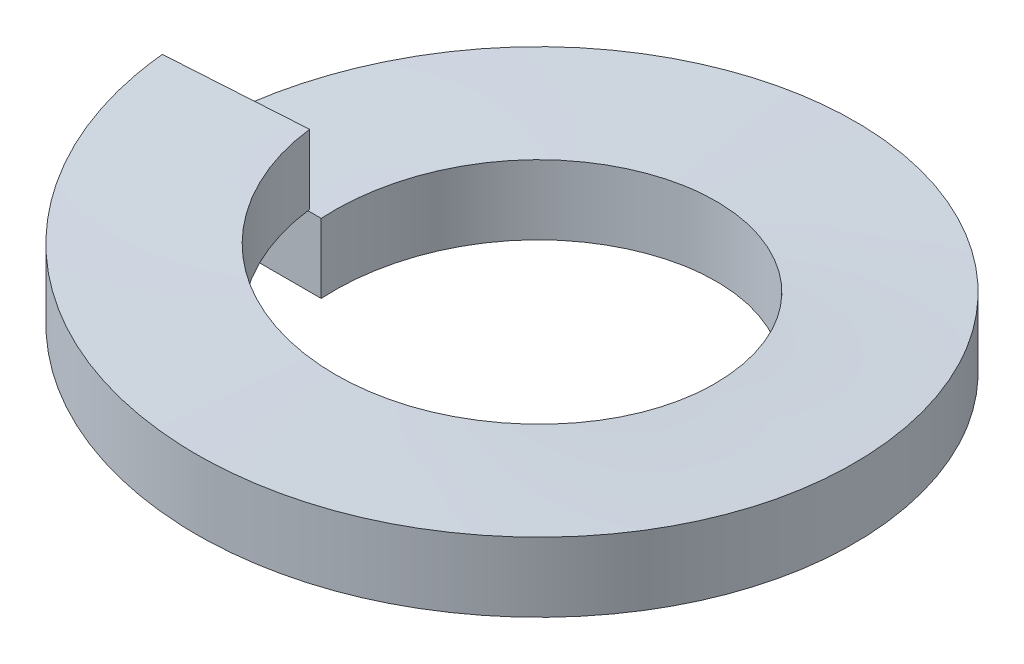
ISO-10303-21;
HEADER;
FILE_DESCRIPTION(('STEP AP214'),'2;1');
FILE_NAME('part.step','',(''),(''),'','','');
FILE_SCHEMA(('AUTOMOTIVE_DESIGN { 1 0 10303 214 1 1 1 1 }'));
ENDSEC;
DATA;
#1=APPLICATION_CONTEXT('core data for automotive mechanical design processes');
#2=APPLICATION_PROTOCOL_DEFINITION('international standard','automotive_design',2000,#1);
#3=PRODUCT_CONTEXT('',#1,'mechanical');
#4=PRODUCT('Part','Part','',(#3));
#5=PRODUCT_RELATED_PRODUCT_CATEGORY('part','',(#4));
#6=PRODUCT_DEFINITION_FORMATION('','',#4);
#7=PRODUCT_DEFINITION_CONTEXT('part definition',#1,'design');
#8=PRODUCT_DEFINITION('design','',#6,#7);
#9=PRODUCT_DEFINITION_SHAPE('','',#8);
#10=(LENGTH_UNIT() NAMED_UNIT(*) SI_UNIT(.MILLI.,.METRE.));
#11=(NAMED_UNIT(*) PLANE_ANGLE_UNIT() SI_UNIT($,.RADIAN.));
#12=(NAMED_UNIT(*) SI_UNIT($,.STERADIAN.) SOLID_ANGLE_UNIT());
#13=UNCERTAINTY_MEASURE_WITH_UNIT(LENGTH_MEASURE(1.E-05),#10,'distance_accuracy_value','');
#14=(GEOMETRIC_REPRESENTATION_CONTEXT(3) GLOBAL_UNCERTAINTY_ASSIGNED_CONTEXT((#13)) GLOBAL_UNIT_ASSIGNED_CONTEXT((#10,
#11,#12)) REPRESENTATION_CONTEXT('',''));
#15=CARTESIAN_POINT('',(0.,0.,0.));
#16=DIRECTION('',(0.,0.,1.));
#17=DIRECTION('',(1.,0.,0.));
#18=AXIS2_PLACEMENT_3D('',#15,#16,#17);
#19=CARTESIAN_POINT('',(0.,0.,0.));
#20=DIRECTION('',(0.,1.,0.));
#21=DIRECTION('',(1.,0.,0.));
#22=AXIS2_PLACEMENT_3D('',#19,#20,#21);
#23=CYLINDRICAL_SURFACE('',#22,2.2);
#24=CARTESIAN_POINT('',(-2.2,0.,0.));
#25=CARTESIAN_POINT('',(-2.2,0.08,-1.25485784528125));
#26=CARTESIAN_POINT('',(-1.11989111465081,0.16,-1.89363245940868));
#27=CARTESIAN_POINT('',(-0.601851894780919,0.1983694071512,-2.2));
#28=CARTESIAN_POINT('',(0.,0.242536206277147,-2.2));
#29=(BOUNDED_CURVE() B_SPLINE_CURVE(2,(#24,#25,#26,#27,#28),.UNSPECIFIED.,.F.,
.F.) B_SPLINE_CURVE_WITH_KNOTS((3,2,3),(0.,0.166666666666667,0.252468503816904),
.UNSPECIFIED.) CURVE() GEOMETRIC_REPRESENTATION_ITEM() RATIONAL_B_SPLINE_CURVE((1.,
0.868631514438191,1.,0.932370055570913,0.934373392882436)) REPRESENTATION_ITEM(''));
#30=CARTESIAN_POINT('',(-2.2,0.,0.));
#31=VERTEX_POINT('',#30);
#32=CARTESIAN_POINT('',(0.,0.242536206277147,-2.2));
#33=VERTEX_POINT('',#32);
#34=EDGE_CURVE('E10',#31,#33,#29,.T.);
#35=ORIENTED_EDGE('',*,*,#34,.T.);
#36=CARTESIAN_POINT('',(0.,0.242536206277147,-2.2));
#37=CARTESIAN_POINT('',(0.564863992809004,0.283988654496086,-2.2));
#38=CARTESIAN_POINT('',(1.05985808302378,0.32,-1.9278746960965));
#39=CARTESIAN_POINT('',(2.15949839534919,0.4,-1.32334231865688));
#40=CARTESIAN_POINT('',(2.19891443280461,0.48,-0.0691036699718665));
#41=CARTESIAN_POINT('',(2.23833047026003,0.56,1.18513497871315));
#42=CARTESIAN_POINT('',(1.17881894895378,0.64,1.85752143610444));
#43=CARTESIAN_POINT('',(0.639159084810205,0.680747824127725,2.2));
#44=CARTESIAN_POINT('',(0.,0.727606115902046,2.2));
#45=(BOUNDED_CURVE() B_SPLINE_CURVE(2,(#36,#37,#38,#39,#40,#41,#42,#43,#44),.UNSPECIFIED.,.F.,
.F.) B_SPLINE_CURVE_WITH_KNOTS((3,2,2,2,3),(0.252468503816904,0.333333333333333,0.5,
0.666666666666667,0.757406729884102),
.UNSPECIFIED.) CURVE() GEOMETRIC_REPRESENTATION_ITEM() RATIONAL_B_SPLINE_CURVE((0.934373392882436,
0.936261458867277,1.,0.868631514438191,1.,0.868631514438191,1.,0.928477691892056,0.934834648894173)) REPRESENTATION_ITEM(''));
#46=CARTESIAN_POINT('',(0.,0.727606115902047,2.2));
#47=VERTEX_POINT('',#46);
#48=EDGE_CURVE('E24',#33,#47,#45,.T.);
#49=ORIENTED_EDGE('',*,*,#48,.T.);
#50=CARTESIAN_POINT('',(0.,0.727606115902046,2.2));
#51=CARTESIAN_POINT('',(-0.528173269976269,0.766327770307217,2.2));
#52=CARTESIAN_POINT('',(-0.998779099427025,0.8,1.9602143532144));
#53=CARTESIAN_POINT('',(-2.11686562650157,0.88,1.39052081293306));
#54=CARTESIAN_POINT('',(-2.1956588025422,0.96,0.138139142964459));
#55=(BOUNDED_CURVE() B_SPLINE_CURVE(2,(#50,#51,#52,#53,#54),.UNSPECIFIED.,.F.,
.F.) B_SPLINE_CURVE_WITH_KNOTS((3,2,3),(0.757406729884102,0.833333333333333,1.),
.UNSPECIFIED.) CURVE() GEOMETRIC_REPRESENTATION_ITEM() RATIONAL_B_SPLINE_CURVE((0.934834648894173,
0.940153822546135,1.,0.868631514438191,1.)) REPRESENTATION_ITEM(''));
#56=CARTESIAN_POINT('',(-2.1956588025422,0.96,0.138139142964459));
#57=VERTEX_POINT('',#56);
#58=EDGE_CURVE('E174',#47,#57,#55,.T.);
#59=ORIENTED_EDGE('',*,*,#58,.T.);
#60=DIRECTION('',(0.,1.,0.));
#61=VECTOR('',#60,1.);
#62=CARTESIAN_POINT('',(-2.1956588025422,0.96,0.13813914296446));
#63=LINE('',#62,#61);
#64=CARTESIAN_POINT('',(-2.1956588025422,1.76,0.138139142964459));
#65=VERTEX_POINT('',#64);
#66=EDGE_CURVE('E96',#57,#65,#63,.T.);
#67=ORIENTED_EDGE('',*,*,#66,.T.);
#68=CARTESIAN_POINT('',(0.,1.52760611590205,2.2));
#69=CARTESIAN_POINT('',(-0.528173269976269,1.56632777030722,2.2));
#70=CARTESIAN_POINT('',(-0.998779099427025,1.6,1.9602143532144));
#71=CARTESIAN_POINT('',(-2.11686562650157,1.68,1.39052081293306));
#72=CARTESIAN_POINT('',(-2.1956588025422,1.76,0.138139142964459));
#73=(BOUNDED_CURVE() B_SPLINE_CURVE(2,(#68,#69,#70,#71,#72),.UNSPECIFIED.,.F.,
.F.) B_SPLINE_CURVE_WITH_KNOTS((3,2,3),(0.757406729884102,0.833333333333333,1.),
.UNSPECIFIED.) CURVE() GEOMETRIC_REPRESENTATION_ITEM() RATIONAL_B_SPLINE_CURVE((0.934834648894173,
0.940153822546135,1.,0.868631514438191,1.)) REPRESENTATION_ITEM(''));
#74=CARTESIAN_POINT('',(0.,1.52760611590205,2.2));
#75=VERTEX_POINT('',#74);
#76=EDGE_CURVE('E163',#75,#65,#73,.T.);
#77=ORIENTED_EDGE('',*,*,#76,.F.);
#78=CARTESIAN_POINT('',(0.,1.04253620627715,-2.2));
#79=CARTESIAN_POINT('',(0.564863992809004,1.08398865449609,-2.2));
#80=CARTESIAN_POINT('',(1.05985808302378,1.12,-1.9278746960965));
#81=CARTESIAN_POINT('',(2.15949839534919,1.2,-1.32334231865688));
#82=CARTESIAN_POINT('',(2.19891443280461,1.28,-0.0691036699718665));
#83=CARTESIAN_POINT('',(2.23833047026003,1.36,1.18513497871315));
#84=CARTESIAN_POINT('',(1.17881894895378,1.44,1.85752143610444));
#85=CARTESIAN_POINT('',(0.639159084810205,1.48074782412773,2.2));
#86=CARTESIAN_POINT('',(0.,1.52760611590205,2.2));
#87=(BOUNDED_CURVE() B_SPLINE_CURVE(2,(#78,#79,#80,#81,#82,#83,#84,#85,#86),.UNSPECIFIED.,.F.,
.F.) B_SPLINE_CURVE_WITH_KNOTS((3,2,2,2,3),(0.252468503816904,0.333333333333333,0.5,
0.666666666666667,0.757406729884102),
.UNSPECIFIED.) CURVE() GEOMETRIC_REPRESENTATION_ITEM() RATIONAL_B_SPLINE_CURVE((0.934373392882436,
0.936261458867277,1.,0.868631514438191,1.,0.868631514438191,1.,0.928477691892056,0.934834648894173)) REPRESENTATION_ITEM(''));
#88=CARTESIAN_POINT('',(0.,1.04253620627715,-2.2));
#89=VERTEX_POINT('',#88);
#90=EDGE_CURVE('E102',#89,#75,#87,.T.);
#91=ORIENTED_EDGE('',*,*,#90,.F.);
#92=CARTESIAN_POINT('',(-2.2,0.8,0.));
#93=CARTESIAN_POINT('',(-2.2,0.88,-1.25485784528125));
#94=CARTESIAN_POINT('',(-1.11989111465081,0.96,-1.89363245940868));
#95=CARTESIAN_POINT('',(-0.601851894780919,0.9983694071512,-2.2));
#96=CARTESIAN_POINT('',(0.,1.04253620627715,-2.2));
#97=(BOUNDED_CURVE() B_SPLINE_CURVE(2,(#92,#93,#94,#95,#96),.UNSPECIFIED.,.F.,
.F.) B_SPLINE_CURVE_WITH_KNOTS((3,2,3),(0.,0.166666666666667,0.252468503816904),
.UNSPECIFIED.) CURVE() GEOMETRIC_REPRESENTATION_ITEM() RATIONAL_B_SPLINE_CURVE((1.,
0.868631514438191,1.,0.932370055570913,0.934373392882436)) REPRESENTATION_ITEM(''));
#98=CARTESIAN_POINT('',(-2.2,0.8,0.));
#99=VERTEX_POINT('',#98);
#100=EDGE_CURVE('E99',#99,#89,#97,.T.);
#101=ORIENTED_EDGE('',*,*,#100,.F.);
#102=DIRECTION('',(0.,1.,0.));
#103=VECTOR('',#102,1.);
#104=CARTESIAN_POINT('',(-2.2,0.,0.));
#105=LINE('',#104,#103);
#106=EDGE_CURVE('E108',#31,#99,#105,.T.);
#107=ORIENTED_EDGE('',*,*,#106,.F.);
#108=EDGE_LOOP('',(#35,#49,#59,#67,#77,#91,#101,#107));
#109=FACE_BOUND('',#108,.T.);
#110=ADVANCED_FACE('F15',(#109),#23,.F.);
#111=CARTESIAN_POINT('',(0.,0.,0.));
#112=DIRECTION('',(0.,1.,0.));
#113=DIRECTION('',(1.,0.,0.));
#114=AXIS2_PLACEMENT_3D('',#111,#112,#113);
#115=CYLINDRICAL_SURFACE('',#114,3.8);
#116=CARTESIAN_POINT('',(0.,0.242536206277147,-3.8));
#117=CARTESIAN_POINT('',(0.975674169397371,0.283988654496086,-3.8));
#118=CARTESIAN_POINT('',(1.83066396158653,0.32,-3.32996538416667));
#119=CARTESIAN_POINT('',(3.73004268287587,0.4,-2.28577309586189));
#120=CARTESIAN_POINT('',(3.79812492938978,0.48,-0.11936088449686));
#121=CARTESIAN_POINT('',(3.86620717590369,0.56,2.04705132686817));
#122=CARTESIAN_POINT('',(2.03614182092016,0.64,3.20844611690768));
#123=CARTESIAN_POINT('',(1.10400205558126,0.680747824127725,3.8));
#124=CARTESIAN_POINT('',(0.,0.727606115902046,3.8));
#125=(BOUNDED_CURVE() B_SPLINE_CURVE(2,(#116,#117,#118,#119,#120,#121,#122,#123,#124),
.UNSPECIFIED.,.F.,.F.) B_SPLINE_CURVE_WITH_KNOTS((3,2,2,2,3),(0.252468503816904,
0.333333333333333,0.5,0.666666666666667,0.757406729884102),
.UNSPECIFIED.) CURVE() GEOMETRIC_REPRESENTATION_ITEM() RATIONAL_B_SPLINE_CURVE((0.934373392882436,
0.936261458867277,1.,0.868631514438191,1.,0.868631514438191,1.,0.928477691892056,0.934834648894173)) REPRESENTATION_ITEM(''));
#126=CARTESIAN_POINT('',(0.,0.242536206277147,-3.8));
#127=VERTEX_POINT('',#126);
#128=CARTESIAN_POINT('',(0.,0.727606115902047,3.8));
#129=VERTEX_POINT('',#128);
#130=EDGE_CURVE('E85',#127,#129,#125,.T.);
#131=ORIENTED_EDGE('',*,*,#130,.F.);
#132=CARTESIAN_POINT('',(-3.8,0.,0.));
#133=CARTESIAN_POINT('',(-3.8,0.08,-2.16748173275853));
#134=CARTESIAN_POINT('',(-1.9343573798514,0.16,-3.27081970261499));
#135=CARTESIAN_POINT('',(-1.0395623637125,0.1983694071512,-3.8));
#136=CARTESIAN_POINT('',(0.,0.242536206277147,-3.8));
#137=(BOUNDED_CURVE() B_SPLINE_CURVE(2,(#132,#133,#134,#135,#136),.UNSPECIFIED.,.F.,
.F.) B_SPLINE_CURVE_WITH_KNOTS((3,2,3),(0.,0.166666666666667,0.252468503816904),
.UNSPECIFIED.) CURVE() GEOMETRIC_REPRESENTATION_ITEM() RATIONAL_B_SPLINE_CURVE((1.,
0.868631514438191,1.,0.932370055570913,0.934373392882436)) REPRESENTATION_ITEM(''));
#138=CARTESIAN_POINT('',(-3.8,0.,0.));
#139=VERTEX_POINT('',#138);
#140=EDGE_CURVE('E109',#139,#127,#137,.T.);
#141=ORIENTED_EDGE('',*,*,#140,.F.);
#142=DIRECTION('',(0.,-1.,0.));
#143=VECTOR('',#142,1.);
#144=CARTESIAN_POINT('',(-3.8,0.8,0.));
#145=LINE('',#144,#143);
#146=CARTESIAN_POINT('',(-3.8,0.8,0.));
#147=VERTEX_POINT('',#146);
#148=EDGE_CURVE('E92',#147,#139,#145,.T.);
#149=ORIENTED_EDGE('',*,*,#148,.F.);
#150=CARTESIAN_POINT('',(-3.8,0.8,0.));
#151=CARTESIAN_POINT('',(-3.8,0.88,-2.16748173275853));
#152=CARTESIAN_POINT('',(-1.9343573798514,0.96,-3.27081970261499));
#153=CARTESIAN_POINT('',(-1.0395623637125,0.9983694071512,-3.8));
#154=CARTESIAN_POINT('',(0.,1.04253620627715,-3.8));
#155=(BOUNDED_CURVE() B_SPLINE_CURVE(2,(#150,#151,#152,#153,#154),.UNSPECIFIED.,.F.,
.F.) B_SPLINE_CURVE_WITH_KNOTS((3,2,3),(0.,0.166666666666667,0.252468503816904),
.UNSPECIFIED.) CURVE() GEOMETRIC_REPRESENTATION_ITEM() RATIONAL_B_SPLINE_CURVE((1.,
0.868631514438191,1.,0.932370055570913,0.934373392882436)) REPRESENTATION_ITEM(''));
#156=CARTESIAN_POINT('',(0.,1.04253620627715,-3.8));
#157=VERTEX_POINT('',#156);
#158=EDGE_CURVE('E128',#147,#157,#155,.T.);
#159=ORIENTED_EDGE('',*,*,#158,.T.);
#160=CARTESIAN_POINT('',(0.,1.04253620627715,-3.8));
#161=CARTESIAN_POINT('',(0.975674169397371,1.08398865449609,-3.8));
#162=CARTESIAN_POINT('',(1.83066396158653,1.12,-3.32996538416667));
#163=CARTESIAN_POINT('',(3.73004268287587,1.2,-2.28577309586189));
#164=CARTESIAN_POINT('',(3.79812492938978,1.28,-0.11936088449686));
#165=CARTESIAN_POINT('',(3.86620717590369,1.36,2.04705132686817));
#166=CARTESIAN_POINT('',(2.03614182092016,1.44,3.20844611690768));
#167=CARTESIAN_POINT('',(1.10400205558126,1.48074782412773,3.8));
#168=CARTESIAN_POINT('',(0.,1.52760611590205,3.8));
#169=(BOUNDED_CURVE() B_SPLINE_CURVE(2,(#160,#161,#162,#163,#164,#165,#166,#167,#168),
.UNSPECIFIED.,.F.,.F.) B_SPLINE_CURVE_WITH_KNOTS((3,2,2,2,3),(0.252468503816904,
0.333333333333333,0.5,0.666666666666667,0.757406729884102),
.UNSPECIFIED.) CURVE() GEOMETRIC_REPRESENTATION_ITEM() RATIONAL_B_SPLINE_CURVE((0.934373392882436,
0.936261458867277,1.,0.868631514438191,1.,0.868631514438191,1.,0.928477691892056,0.934834648894173)) REPRESENTATION_ITEM(''));
#170=CARTESIAN_POINT('',(0.,1.52760611590205,3.8));
#171=VERTEX_POINT('',#170);
#172=EDGE_CURVE('E121',#157,#171,#169,.T.);
#173=ORIENTED_EDGE('',*,*,#172,.T.);
#174=CARTESIAN_POINT('',(0.,1.52760611590205,3.8));
#175=CARTESIAN_POINT('',(-0.912299284504465,1.56632777030722,3.8));
#176=CARTESIAN_POINT('',(-1.72516389901032,1.6,3.38582479191578));
#177=CARTESIAN_POINT('',(-3.65640426395726,1.68,2.40180867688437));
#178=CARTESIAN_POINT('',(-3.79250156802744,1.76,0.238603974211338));
#179=(BOUNDED_CURVE() B_SPLINE_CURVE(2,(#174,#175,#176,#177,#178),.UNSPECIFIED.,.F.,
.F.) B_SPLINE_CURVE_WITH_KNOTS((3,2,3),(0.757406729884102,0.833333333333333,1.),
.UNSPECIFIED.) CURVE() GEOMETRIC_REPRESENTATION_ITEM() RATIONAL_B_SPLINE_CURVE((0.934834648894173,
0.940153822546135,1.,0.868631514438191,1.)) REPRESENTATION_ITEM(''));
#180=CARTESIAN_POINT('',(-3.79250156802744,1.76,0.238603974211338));
#181=VERTEX_POINT('',#180);
#182=EDGE_CURVE('E90',#171,#181,#179,.T.);
#183=ORIENTED_EDGE('',*,*,#182,.T.);
#184=DIRECTION('',(0.,-1.,0.));
#185=VECTOR('',#184,1.);
#186=CARTESIAN_POINT('',(-3.79250156802744,1.76,0.23860397421134));
#187=LINE('',#186,#185);
#188=CARTESIAN_POINT('',(-3.79250156802744,0.96,0.238603974211338));
#189=VERTEX_POINT('',#188);
#190=EDGE_CURVE('E75',#181,#189,#187,.T.);
#191=ORIENTED_EDGE('',*,*,#190,.T.);
#192=CARTESIAN_POINT('',(0.,0.727606115902046,3.8));
#193=CARTESIAN_POINT('',(-0.912299284504465,0.766327770307217,3.8));
#194=CARTESIAN_POINT('',(-1.72516389901032,0.8,3.38582479191578));
#195=CARTESIAN_POINT('',(-3.65640426395726,0.88,2.40180867688437));
#196=CARTESIAN_POINT('',(-3.79250156802744,0.96,0.238603974211338));
#197=(BOUNDED_CURVE() B_SPLINE_CURVE(2,(#192,#193,#194,#195,#196),.UNSPECIFIED.,.F.,
.F.) B_SPLINE_CURVE_WITH_KNOTS((3,2,3),(0.757406729884102,0.833333333333333,1.),
.UNSPECIFIED.) CURVE() GEOMETRIC_REPRESENTATION_ITEM() RATIONAL_B_SPLINE_CURVE((0.934834648894173,
0.940153822546135,1.,0.868631514438191,1.)) REPRESENTATION_ITEM(''));
#198=EDGE_CURVE('E81',#129,#189,#197,.T.);
#199=ORIENTED_EDGE('',*,*,#198,.F.);
#200=EDGE_LOOP('',(#131,#141,#149,#159,#173,#183,#191,#199));
#201=FACE_BOUND('',#200,.T.);
#202=ADVANCED_FACE('F88',(#201),#115,.T.);
#203=CARTESIAN_POINT('',(-3.8,0.,0.));
#204=DIRECTION('',(0.,0.,1.));
#205=DIRECTION('',(1.,0.,0.));
#206=AXIS2_PLACEMENT_3D('',#203,#204,#205);
#207=PLANE('',#206);
#208=ORIENTED_EDGE('',*,*,#148,.T.);
#209=DIRECTION('',(1.,0.,0.));
#210=VECTOR('',#209,1.);
#211=CARTESIAN_POINT('',(-3.8,0.,0.));
#212=LINE('',#211,#210);
#213=EDGE_CURVE('E110',#139,#31,#212,.T.);
#214=ORIENTED_EDGE('',*,*,#213,.T.);
#215=ORIENTED_EDGE('',*,*,#106,.T.);
#216=DIRECTION('',(-1.,0.,0.));
#217=VECTOR('',#216,1.);
#218=CARTESIAN_POINT('',(-2.2,0.8,0.));
#219=LINE('',#218,#217);
#220=EDGE_CURVE('E105',#99,#147,#219,.T.);
#221=ORIENTED_EDGE('',*,*,#220,.T.);
#222=EDGE_LOOP('',(#208,#214,#215,#221));
#223=FACE_BOUND('',#222,.T.);
#224=ADVANCED_FACE('F193',(#223),#207,.T.);
#225=CARTESIAN_POINT('',(-3.79250156802744,0.96,0.23860397421134));
#226=DIRECTION('',(0.0627905195293,0.,0.998026728428272));
#227=DIRECTION('',(0.998026728428272,0.,-0.0627905195293));
#228=AXIS2_PLACEMENT_3D('',#225,#226,#227);
#229=PLANE('',#228);
#230=ORIENTED_EDGE('',*,*,#190,.F.);
#231=DIRECTION('',(-0.998026728428273,0.,0.0627905195293));
#232=VECTOR('',#231,1.);
#233=CARTESIAN_POINT('',(-2.1956588025422,1.76,0.13813914296446));
#234=LINE('',#233,#232);
#235=EDGE_CURVE('E98',#65,#181,#234,.T.);
#236=ORIENTED_EDGE('',*,*,#235,.F.);
#237=ORIENTED_EDGE('',*,*,#66,.F.);
#238=DIRECTION('',(0.998026728428273,0.,-0.0627905195293));
#239=VECTOR('',#238,1.);
#240=CARTESIAN_POINT('',(-3.79250156802744,0.96,0.23860397421134));
#241=LINE('',#240,#239);
#242=EDGE_CURVE('E18',#189,#57,#241,.T.);
#243=ORIENTED_EDGE('',*,*,#242,.F.);
#244=EDGE_LOOP('',(#230,#236,#237,#243));
#245=FACE_BOUND('',#244,.T.);
#246=ADVANCED_FACE('F94',(#245),#229,.F.);
#247=CARTESIAN_POINT('',(-3.8,0.,0.));
#248=CARTESIAN_POINT('',(-3.8,0.08,-2.16748173275853));
#249=CARTESIAN_POINT('',(-1.9343573798514,0.16,-3.27081970261499));
#250=CARTESIAN_POINT('',(-0.0687147597028062,0.24,-4.37415767247145));
#251=CARTESIAN_POINT('',(1.83066396158653,0.32,-3.32996538416667));
#252=CARTESIAN_POINT('',(3.73004268287587,0.4,-2.28577309586189));
#253=CARTESIAN_POINT('',(3.79812492938978,0.48,-0.11936088449686));
#254=CARTESIAN_POINT('',(3.86620717590369,0.56,2.04705132686817));
#255=CARTESIAN_POINT('',(2.03614182092016,0.64,3.20844611690768));
#256=CARTESIAN_POINT('',(0.206076465936626,0.72,4.36984090694718));
#257=CARTESIAN_POINT('',(-1.72516389901032,0.8,3.38582479191578));
#258=CARTESIAN_POINT('',(-3.65640426395726,0.88,2.40180867688437));
#259=CARTESIAN_POINT('',(-3.79250156802744,0.96,0.238603974211336));
#260=CARTESIAN_POINT('',(-2.2,0.,0.));
#261=CARTESIAN_POINT('',(-2.2,0.08,-1.25485784528125));
#262=CARTESIAN_POINT('',(-1.11989111465081,0.16,-1.89363245940868));
#263=CARTESIAN_POINT('',(-0.0397822293016247,0.24,-2.53240707353611));
#264=CARTESIAN_POINT('',(1.05985808302378,0.32,-1.9278746960965));
#265=CARTESIAN_POINT('',(2.15949839534919,0.4,-1.32334231865689));
#266=CARTESIAN_POINT('',(2.19891443280461,0.48,-0.0691036699718665));
#267=CARTESIAN_POINT('',(2.23833047026003,0.56,1.18513497871315));
#268=CARTESIAN_POINT('',(1.17881894895378,0.64,1.85752143610444));
#269=CARTESIAN_POINT('',(0.11930742764752,0.72,2.52990789349574));
#270=CARTESIAN_POINT('',(-0.998779099427025,0.8,1.9602143532144));
#271=CARTESIAN_POINT('',(-2.11686562650157,0.88,1.39052081293306));
#272=CARTESIAN_POINT('',(-2.1956588025422,0.96,0.138139142964458));
#273=(BOUNDED_SURFACE() B_SPLINE_SURFACE(1,2,((#247,#248,#249,#250,#251,#252,#253,#254,#255,
#256,#257,#258,#259),(#260,#261,#262,#263,#264,#265,#266,#267,#268,#269,#270,#271,#272)),
.UNSPECIFIED.,.F.,.F.,.F.) B_SPLINE_SURFACE_WITH_KNOTS((2,2),(3,2,2,2,2,2,3),(0.,1.),(0.,
0.166666666666667,0.333333333333333,0.5,0.666666666666667,0.833333333333333,1.),
.UNSPECIFIED.) GEOMETRIC_REPRESENTATION_ITEM() RATIONAL_B_SPLINE_SURFACE(((1.,0.868631514438191,
1.,0.868631514438191,1.,0.868631514438191,1.,0.868631514438191,1.,0.868631514438191,1.,
0.868631514438191,1.),(1.,0.868631514438191,1.,0.868631514438191,1.,0.868631514438191,1.,
0.868631514438191,1.,0.868631514438191,1.,0.868631514438191,1.))) REPRESENTATION_ITEM('') SURFACE());
#274=ORIENTED_EDGE('',*,*,#34,.F.);
#275=ORIENTED_EDGE('',*,*,#213,.F.);
#276=ORIENTED_EDGE('',*,*,#140,.T.);
#277=ORIENTED_EDGE('',*,*,#130,.T.);
#278=ORIENTED_EDGE('',*,*,#198,.T.);
#279=ORIENTED_EDGE('',*,*,#242,.T.);
#280=ORIENTED_EDGE('',*,*,#58,.F.);
#281=ORIENTED_EDGE('',*,*,#48,.F.);
#282=EDGE_LOOP('',(#274,#275,#276,#277,#278,#279,#280,#281));
#283=FACE_BOUND('',#282,.T.);
#284=ADVANCED_FACE('F82',(#283),#273,.F.);
#285=CARTESIAN_POINT('',(-2.2,0.8,0.));
#286=CARTESIAN_POINT('',(-2.2,0.88,-1.25485784528125));
#287=CARTESIAN_POINT('',(-1.11989111465081,0.96,-1.89363245940868));
#288=CARTESIAN_POINT('',(-0.0397822293016247,1.04,-2.53240707353611));
#289=CARTESIAN_POINT('',(1.05985808302378,1.12,-1.9278746960965));
#290=CARTESIAN_POINT('',(2.15949839534919,1.2,-1.32334231865689));
#291=CARTESIAN_POINT('',(2.19891443280461,1.28,-0.0691036699718665));
#292=CARTESIAN_POINT('',(2.23833047026003,1.36,1.18513497871315));
#293=CARTESIAN_POINT('',(1.17881894895378,1.44,1.85752143610444));
#294=CARTESIAN_POINT('',(0.11930742764752,1.52,2.52990789349574));
#295=CARTESIAN_POINT('',(-0.998779099427025,1.6,1.9602143532144));
#296=CARTESIAN_POINT('',(-2.11686562650157,1.68,1.39052081293306));
#297=CARTESIAN_POINT('',(-2.1956588025422,1.76,0.138139142964458));
#298=CARTESIAN_POINT('',(-3.8,0.8,0.));
#299=CARTESIAN_POINT('',(-3.8,0.88,-2.16748173275853));
#300=CARTESIAN_POINT('',(-1.9343573798514,0.96,-3.27081970261499));
#301=CARTESIAN_POINT('',(-0.0687147597028062,1.04,-4.37415767247145));
#302=CARTESIAN_POINT('',(1.83066396158653,1.12,-3.32996538416667));
#303=CARTESIAN_POINT('',(3.73004268287587,1.2,-2.28577309586189));
#304=CARTESIAN_POINT('',(3.79812492938978,1.28,-0.11936088449686));
#305=CARTESIAN_POINT('',(3.86620717590369,1.36,2.04705132686817));
#306=CARTESIAN_POINT('',(2.03614182092016,1.44,3.20844611690768));
#307=CARTESIAN_POINT('',(0.206076465936626,1.52,4.36984090694718));
#308=CARTESIAN_POINT('',(-1.72516389901032,1.6,3.38582479191578));
#309=CARTESIAN_POINT('',(-3.65640426395726,1.68,2.40180867688437));
#310=CARTESIAN_POINT('',(-3.79250156802744,1.76,0.238603974211336));
#311=(BOUNDED_SURFACE() B_SPLINE_SURFACE(1,2,((#285,#286,#287,#288,#289,#290,#291,#292,#293,
#294,#295,#296,#297),(#298,#299,#300,#301,#302,#303,#304,#305,#306,#307,#308,#309,#310)),
.UNSPECIFIED.,.F.,.F.,.F.) B_SPLINE_SURFACE_WITH_KNOTS((2,2),(3,2,2,2,2,2,3),(0.,1.),(0.,
0.166666666666667,0.333333333333333,0.5,0.666666666666667,0.833333333333333,1.),
.UNSPECIFIED.) GEOMETRIC_REPRESENTATION_ITEM() RATIONAL_B_SPLINE_SURFACE(((1.,0.868631514438191,
1.,0.868631514438191,1.,0.868631514438191,1.,0.868631514438191,1.,0.868631514438191,1.,
0.868631514438191,1.),(1.,0.868631514438191,1.,0.868631514438191,1.,0.868631514438191,1.,
0.868631514438191,1.,0.868631514438191,1.,0.868631514438191,1.))) REPRESENTATION_ITEM('') SURFACE());
#312=ORIENTED_EDGE('',*,*,#235,.T.);
#313=ORIENTED_EDGE('',*,*,#182,.F.);
#314=ORIENTED_EDGE('',*,*,#172,.F.);
#315=ORIENTED_EDGE('',*,*,#158,.F.);
#316=ORIENTED_EDGE('',*,*,#220,.F.);
#317=ORIENTED_EDGE('',*,*,#100,.T.);
#318=ORIENTED_EDGE('',*,*,#90,.T.);
#319=ORIENTED_EDGE('',*,*,#76,.T.);
#320=EDGE_LOOP('',(#312,#313,#314,#315,#316,#317,#318,#319));
#321=FACE_BOUND('',#320,.T.);
#322=ADVANCED_FACE('F197',(#321),#311,.F.);
#323=CLOSED_SHELL('',(#110,#202,#224,#246,#284,#322));
#324=MANIFOLD_SOLID_BREP('B1',#323);
#325=ADVANCED_BREP_SHAPE_REPRESENTATION('',(#18,#324),#14);
#326=SHAPE_DEFINITION_REPRESENTATION(#9,#325);
ENDSEC;
END-ISO-10303-21;
